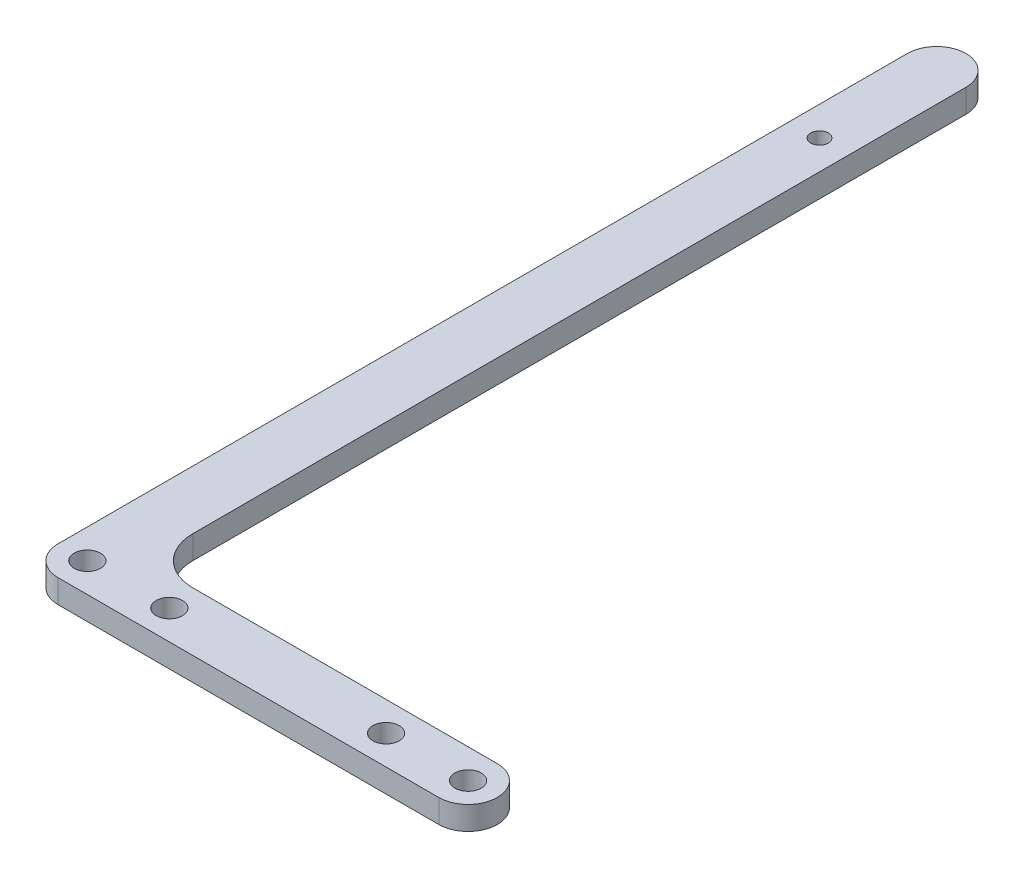
ISO-10303-21;
HEADER;
FILE_DESCRIPTION(('STEP AP214'),'2;1');
FILE_NAME('part.step','',(''),(''),'','','');
FILE_SCHEMA(('AUTOMOTIVE_DESIGN { 1 0 10303 214 1 1 1 1 }'));
ENDSEC;
DATA;
#1=APPLICATION_CONTEXT('core data for automotive mechanical design processes');
#2=APPLICATION_PROTOCOL_DEFINITION('international standard','automotive_design',2000,#1);
#3=PRODUCT_CONTEXT('',#1,'mechanical');
#4=PRODUCT('Part','Part','',(#3));
#5=PRODUCT_RELATED_PRODUCT_CATEGORY('part','',(#4));
#6=PRODUCT_DEFINITION_FORMATION('','',#4);
#7=PRODUCT_DEFINITION_CONTEXT('part definition',#1,'design');
#8=PRODUCT_DEFINITION('design','',#6,#7);
#9=PRODUCT_DEFINITION_SHAPE('','',#8);
#10=(LENGTH_UNIT() NAMED_UNIT(*) SI_UNIT(.MILLI.,.METRE.));
#11=(NAMED_UNIT(*) PLANE_ANGLE_UNIT() SI_UNIT($,.RADIAN.));
#12=(NAMED_UNIT(*) SI_UNIT($,.STERADIAN.) SOLID_ANGLE_UNIT());
#13=UNCERTAINTY_MEASURE_WITH_UNIT(LENGTH_MEASURE(1.E-05),#10,'distance_accuracy_value','');
#14=(GEOMETRIC_REPRESENTATION_CONTEXT(3) GLOBAL_UNCERTAINTY_ASSIGNED_CONTEXT((#13)) GLOBAL_UNIT_ASSIGNED_CONTEXT((#10,
#11,#12)) REPRESENTATION_CONTEXT('',''));
#15=CARTESIAN_POINT('',(0.,0.,0.));
#16=DIRECTION('',(0.,0.,1.));
#17=DIRECTION('',(1.,0.,0.));
#18=AXIS2_PLACEMENT_3D('',#15,#16,#17);
#19=CARTESIAN_POINT('',(5.,4.,-140.));
#20=DIRECTION('',(0.,-1.,0.));
#21=DIRECTION('',(0.,0.,-1.));
#22=AXIS2_PLACEMENT_3D('',#19,#20,#21);
#23=PLANE('',#22);
#24=DIRECTION('',(0.,0.,1.));
#25=VECTOR('',#24,1.);
#26=CARTESIAN_POINT('',(0.,4.,0.));
#27=LINE('',#26,#25);
#28=CARTESIAN_POINT('',(0.,4.,-140.));
#29=VERTEX_POINT('',#28);
#30=CARTESIAN_POINT('',(0.,4.,4.99999999999999));
#31=VERTEX_POINT('',#30);
#32=EDGE_CURVE('E157',#29,#31,#27,.T.);
#33=ORIENTED_EDGE('',*,*,#32,.T.);
#34=CARTESIAN_POINT('',(5.,4.,4.99999999999999));
#35=DIRECTION('',(0.,-1.,0.));
#36=DIRECTION('',(0.,0.,-1.));
#37=AXIS2_PLACEMENT_3D('',#34,#35,#36);
#38=CIRCLE('',#37,5.);
#39=CARTESIAN_POINT('',(5.,4.,9.99999999999999));
#40=VERTEX_POINT('',#39);
#41=EDGE_CURVE('E58',#31,#40,#38,.F.);
#42=ORIENTED_EDGE('',*,*,#41,.T.);
#43=DIRECTION('',(-1.,0.,0.));
#44=VECTOR('',#43,1.);
#45=CARTESIAN_POINT('',(0.,4.,9.99999999999999));
#46=LINE('',#45,#44);
#47=CARTESIAN_POINT('',(70.,4.,9.99999999999997));
#48=VERTEX_POINT('',#47);
#49=EDGE_CURVE('E139',#48,#40,#46,.T.);
#50=ORIENTED_EDGE('',*,*,#49,.F.);
#51=CARTESIAN_POINT('',(70.,4.,5.));
#52=DIRECTION('',(0.,1.,0.));
#53=DIRECTION('',(0.,0.,1.));
#54=AXIS2_PLACEMENT_3D('',#51,#52,#53);
#55=CIRCLE('',#54,4.99999999999998);
#56=CARTESIAN_POINT('',(70.,4.,0.));
#57=VERTEX_POINT('',#56);
#58=EDGE_CURVE('E117',#57,#48,#55,.F.);
#59=ORIENTED_EDGE('',*,*,#58,.F.);
#60=DIRECTION('',(1.,0.,0.));
#61=VECTOR('',#60,1.);
#62=CARTESIAN_POINT('',(0.,4.,0.));
#63=LINE('',#62,#61);
#64=CARTESIAN_POINT('',(18.,4.,0.));
#65=VERTEX_POINT('',#64);
#66=EDGE_CURVE('E137',#65,#57,#63,.T.);
#67=ORIENTED_EDGE('',*,*,#66,.F.);
#68=CARTESIAN_POINT('',(18.,4.,-8.00000000000001));
#69=DIRECTION('',(0.,-1.,0.));
#70=DIRECTION('',(0.,0.,-1.));
#71=AXIS2_PLACEMENT_3D('',#68,#69,#70);
#72=CIRCLE('',#71,8.);
#73=CARTESIAN_POINT('',(10.,4.,-8.00000000000001));
#74=VERTEX_POINT('',#73);
#75=EDGE_CURVE('E181',#65,#74,#72,.T.);
#76=ORIENTED_EDGE('',*,*,#75,.T.);
#77=DIRECTION('',(0.,0.,-1.));
#78=VECTOR('',#77,1.);
#79=CARTESIAN_POINT('',(9.99999999999999,4.,-140.));
#80=LINE('',#79,#78);
#81=CARTESIAN_POINT('',(9.99999999999999,4.,-140.));
#82=VERTEX_POINT('',#81);
#83=EDGE_CURVE('E160',#74,#82,#80,.T.);
#84=ORIENTED_EDGE('',*,*,#83,.T.);
#85=CARTESIAN_POINT('',(5.,4.,-140.));
#86=DIRECTION('',(0.,1.,0.));
#87=DIRECTION('',(0.,0.,-1.));
#88=AXIS2_PLACEMENT_3D('',#85,#86,#87);
#89=CIRCLE('',#88,5.);
#90=EDGE_CURVE('E154',#82,#29,#89,.T.);
#91=ORIENTED_EDGE('',*,*,#90,.T.);
#92=EDGE_LOOP('',(#33,#42,#50,#59,#67,#76,#84,#91));
#93=FACE_BOUND('',#92,.T.);
#94=CARTESIAN_POINT('',(4.99999999999999,4.,-120.));
#95=DIRECTION('',(0.,1.,0.));
#96=DIRECTION('',(0.,0.,1.));
#97=AXIS2_PLACEMENT_3D('',#94,#95,#96);
#98=CIRCLE('',#97,1.5);
#99=CARTESIAN_POINT('',(4.99999999999999,4.,-118.5));
#100=VERTEX_POINT('',#99);
#101=EDGE_CURVE('E148',#100,#100,#98,.T.);
#102=ORIENTED_EDGE('',*,*,#101,.F.);
#103=EDGE_LOOP('',(#102));
#104=FACE_BOUND('',#103,.T.);
#105=CARTESIAN_POINT('',(56.,4.,4.99999999999998));
#106=DIRECTION('',(0.,1.,0.));
#107=DIRECTION('',(0.,0.,1.));
#108=AXIS2_PLACEMENT_3D('',#105,#106,#107);
#109=CIRCLE('',#108,2.25);
#110=CARTESIAN_POINT('',(56.,4.,7.24999999999999));
#111=VERTEX_POINT('',#110);
#112=EDGE_CURVE('E128',#111,#111,#109,.T.);
#113=ORIENTED_EDGE('',*,*,#112,.F.);
#114=EDGE_LOOP('',(#113));
#115=FACE_BOUND('',#114,.T.);
#116=CARTESIAN_POINT('',(19.,4.,4.99999999999999));
#117=DIRECTION('',(0.,1.,0.));
#118=DIRECTION('',(0.,0.,1.));
#119=AXIS2_PLACEMENT_3D('',#116,#117,#118);
#120=CIRCLE('',#119,2.25);
#121=CARTESIAN_POINT('',(19.,4.,7.24999999999999));
#122=VERTEX_POINT('',#121);
#123=EDGE_CURVE('E131',#122,#122,#120,.T.);
#124=ORIENTED_EDGE('',*,*,#123,.F.);
#125=EDGE_LOOP('',(#124));
#126=FACE_BOUND('',#125,.T.);
#127=CARTESIAN_POINT('',(5.,4.,5.));
#128=DIRECTION('',(0.,1.,0.));
#129=DIRECTION('',(0.,0.,1.));
#130=AXIS2_PLACEMENT_3D('',#127,#128,#129);
#131=CIRCLE('',#130,2.25);
#132=CARTESIAN_POINT('',(5.,4.,7.24999999999999));
#133=VERTEX_POINT('',#132);
#134=EDGE_CURVE('E134',#133,#133,#131,.T.);
#135=ORIENTED_EDGE('',*,*,#134,.F.);
#136=EDGE_LOOP('',(#135));
#137=FACE_BOUND('',#136,.T.);
#138=CARTESIAN_POINT('',(70.,4.,5.));
#139=DIRECTION('',(0.,1.,0.));
#140=DIRECTION('',(0.,0.,1.));
#141=AXIS2_PLACEMENT_3D('',#138,#139,#140);
#142=CIRCLE('',#141,2.25);
#143=CARTESIAN_POINT('',(70.,4.,7.24999999999999));
#144=VERTEX_POINT('',#143);
#145=EDGE_CURVE('E142',#144,#144,#142,.T.);
#146=ORIENTED_EDGE('',*,*,#145,.F.);
#147=EDGE_LOOP('',(#146));
#148=FACE_BOUND('',#147,.T.);
#149=ADVANCED_FACE('F36',(#93,#104,#115,#126,#137,#148),#23,.F.);
#150=CARTESIAN_POINT('',(5.,0.,-140.));
#151=DIRECTION('',(0.,-1.,0.));
#152=DIRECTION('',(0.,0.,-1.));
#153=AXIS2_PLACEMENT_3D('',#150,#151,#152);
#154=PLANE('',#153);
#155=DIRECTION('',(-1.,0.,0.));
#156=VECTOR('',#155,1.);
#157=CARTESIAN_POINT('',(0.,0.,9.99999999999999));
#158=LINE('',#157,#156);
#159=CARTESIAN_POINT('',(70.,0.,9.99999999999997));
#160=VERTEX_POINT('',#159);
#161=CARTESIAN_POINT('',(5.,0.,9.99999999999999));
#162=VERTEX_POINT('',#161);
#163=EDGE_CURVE('E104',#160,#162,#158,.T.);
#164=ORIENTED_EDGE('',*,*,#163,.T.);
#165=CARTESIAN_POINT('',(5.,0.,4.99999999999999));
#166=DIRECTION('',(0.,-1.,0.));
#167=DIRECTION('',(0.,0.,-1.));
#168=AXIS2_PLACEMENT_3D('',#165,#166,#167);
#169=CIRCLE('',#168,5.);
#170=CARTESIAN_POINT('',(0.,0.,4.99999999999999));
#171=VERTEX_POINT('',#170);
#172=EDGE_CURVE('E11',#162,#171,#169,.T.);
#173=ORIENTED_EDGE('',*,*,#172,.T.);
#174=DIRECTION('',(0.,0.,1.));
#175=VECTOR('',#174,1.);
#176=CARTESIAN_POINT('',(0.,0.,0.));
#177=LINE('',#176,#175);
#178=CARTESIAN_POINT('',(0.,0.,-140.));
#179=VERTEX_POINT('',#178);
#180=EDGE_CURVE('E165',#179,#171,#177,.T.);
#181=ORIENTED_EDGE('',*,*,#180,.F.);
#182=CARTESIAN_POINT('',(5.,0.,-140.));
#183=DIRECTION('',(0.,1.,0.));
#184=DIRECTION('',(0.,0.,-1.));
#185=AXIS2_PLACEMENT_3D('',#182,#183,#184);
#186=CIRCLE('',#185,5.);
#187=CARTESIAN_POINT('',(9.99999999999999,0.,-140.));
#188=VERTEX_POINT('',#187);
#189=EDGE_CURVE('E151',#188,#179,#186,.T.);
#190=ORIENTED_EDGE('',*,*,#189,.F.);
#191=DIRECTION('',(0.,0.,-1.));
#192=VECTOR('',#191,1.);
#193=CARTESIAN_POINT('',(9.99999999999999,0.,-140.));
#194=LINE('',#193,#192);
#195=CARTESIAN_POINT('',(10.,0.,-8.00000000000001));
#196=VERTEX_POINT('',#195);
#197=EDGE_CURVE('E158',#196,#188,#194,.T.);
#198=ORIENTED_EDGE('',*,*,#197,.F.);
#199=CARTESIAN_POINT('',(18.,0.,-8.00000000000001));
#200=DIRECTION('',(0.,-1.,0.));
#201=DIRECTION('',(0.,0.,-1.));
#202=AXIS2_PLACEMENT_3D('',#199,#200,#201);
#203=CIRCLE('',#202,8.);
#204=CARTESIAN_POINT('',(18.,0.,0.));
#205=VERTEX_POINT('',#204);
#206=EDGE_CURVE('E179',#196,#205,#203,.F.);
#207=ORIENTED_EDGE('',*,*,#206,.T.);
#208=DIRECTION('',(1.,0.,0.));
#209=VECTOR('',#208,1.);
#210=CARTESIAN_POINT('',(0.,0.,0.));
#211=LINE('',#210,#209);
#212=CARTESIAN_POINT('',(70.,0.,0.));
#213=VERTEX_POINT('',#212);
#214=EDGE_CURVE('E107',#205,#213,#211,.T.);
#215=ORIENTED_EDGE('',*,*,#214,.T.);
#216=CARTESIAN_POINT('',(70.,0.,5.));
#217=DIRECTION('',(0.,1.,0.));
#218=DIRECTION('',(0.,0.,1.));
#219=AXIS2_PLACEMENT_3D('',#216,#217,#218);
#220=CIRCLE('',#219,4.99999999999998);
#221=EDGE_CURVE('E100',#213,#160,#220,.F.);
#222=ORIENTED_EDGE('',*,*,#221,.T.);
#223=EDGE_LOOP('',(#164,#173,#181,#190,#198,#207,#215,#222));
#224=FACE_BOUND('',#223,.T.);
#225=CARTESIAN_POINT('',(4.99999999999999,0.,-120.));
#226=DIRECTION('',(0.,1.,0.));
#227=DIRECTION('',(0.,0.,1.));
#228=AXIS2_PLACEMENT_3D('',#225,#226,#227);
#229=CIRCLE('',#228,1.5);
#230=CARTESIAN_POINT('',(4.99999999999999,0.,-118.5));
#231=VERTEX_POINT('',#230);
#232=EDGE_CURVE('E146',#231,#231,#229,.T.);
#233=ORIENTED_EDGE('',*,*,#232,.T.);
#234=EDGE_LOOP('',(#233));
#235=FACE_BOUND('',#234,.T.);
#236=CARTESIAN_POINT('',(56.,0.,4.99999999999998));
#237=DIRECTION('',(0.,1.,0.));
#238=DIRECTION('',(0.,0.,1.));
#239=AXIS2_PLACEMENT_3D('',#236,#237,#238);
#240=CIRCLE('',#239,2.25);
#241=CARTESIAN_POINT('',(56.,0.,7.24999999999999));
#242=VERTEX_POINT('',#241);
#243=EDGE_CURVE('E145',#242,#242,#240,.T.);
#244=ORIENTED_EDGE('',*,*,#243,.T.);
#245=EDGE_LOOP('',(#244));
#246=FACE_BOUND('',#245,.T.);
#247=CARTESIAN_POINT('',(19.,0.,4.99999999999999));
#248=DIRECTION('',(0.,1.,0.));
#249=DIRECTION('',(0.,0.,1.));
#250=AXIS2_PLACEMENT_3D('',#247,#248,#249);
#251=CIRCLE('',#250,2.25);
#252=CARTESIAN_POINT('',(19.,0.,7.24999999999999));
#253=VERTEX_POINT('',#252);
#254=EDGE_CURVE('E362',#253,#253,#251,.T.);
#255=ORIENTED_EDGE('',*,*,#254,.T.);
#256=EDGE_LOOP('',(#255));
#257=FACE_BOUND('',#256,.T.);
#258=CARTESIAN_POINT('',(5.,0.,5.));
#259=DIRECTION('',(0.,1.,0.));
#260=DIRECTION('',(0.,0.,1.));
#261=AXIS2_PLACEMENT_3D('',#258,#259,#260);
#262=CIRCLE('',#261,2.25);
#263=CARTESIAN_POINT('',(5.,0.,7.24999999999999));
#264=VERTEX_POINT('',#263);
#265=EDGE_CURVE('E122',#264,#264,#262,.T.);
#266=ORIENTED_EDGE('',*,*,#265,.T.);
#267=EDGE_LOOP('',(#266));
#268=FACE_BOUND('',#267,.T.);
#269=CARTESIAN_POINT('',(70.,0.,5.));
#270=DIRECTION('',(0.,1.,0.));
#271=DIRECTION('',(0.,0.,1.));
#272=AXIS2_PLACEMENT_3D('',#269,#270,#271);
#273=CIRCLE('',#272,2.25);
#274=CARTESIAN_POINT('',(70.,0.,7.24999999999999));
#275=VERTEX_POINT('',#274);
#276=EDGE_CURVE('E111',#275,#275,#273,.T.);
#277=ORIENTED_EDGE('',*,*,#276,.T.);
#278=EDGE_LOOP('',(#277));
#279=FACE_BOUND('',#278,.T.);
#280=ADVANCED_FACE('F102',(#224,#235,#246,#257,#268,#279),#154,.T.);
#281=CARTESIAN_POINT('',(5.,4.,-140.));
#282=DIRECTION('',(0.,-1.,0.));
#283=DIRECTION('',(0.,0.,-1.));
#284=AXIS2_PLACEMENT_3D('',#281,#282,#283);
#285=CYLINDRICAL_SURFACE('',#284,5.);
#286=ORIENTED_EDGE('',*,*,#189,.T.);
#287=DIRECTION('',(0.,-1.,0.));
#288=VECTOR('',#287,1.);
#289=CARTESIAN_POINT('',(0.,4.,-140.));
#290=LINE('',#289,#288);
#291=EDGE_CURVE('E171',#29,#179,#290,.T.);
#292=ORIENTED_EDGE('',*,*,#291,.F.);
#293=ORIENTED_EDGE('',*,*,#90,.F.);
#294=DIRECTION('',(0.,-1.,0.));
#295=VECTOR('',#294,1.);
#296=CARTESIAN_POINT('',(9.99999999999999,4.,-140.));
#297=LINE('',#296,#295);
#298=EDGE_CURVE('E162',#82,#188,#297,.T.);
#299=ORIENTED_EDGE('',*,*,#298,.T.);
#300=EDGE_LOOP('',(#286,#292,#293,#299));
#301=FACE_BOUND('',#300,.T.);
#302=ADVANCED_FACE('F196',(#301),#285,.T.);
#303=CARTESIAN_POINT('',(0.,4.,0.));
#304=DIRECTION('',(1.,0.,0.));
#305=DIRECTION('',(0.,0.,-1.));
#306=AXIS2_PLACEMENT_3D('',#303,#304,#305);
#307=PLANE('',#306);
#308=ORIENTED_EDGE('',*,*,#180,.T.);
#309=DIRECTION('',(0.,1.,0.));
#310=VECTOR('',#309,1.);
#311=CARTESIAN_POINT('',(0.,4.,4.99999999999999));
#312=LINE('',#311,#310);
#313=EDGE_CURVE('E183',#171,#31,#312,.T.);
#314=ORIENTED_EDGE('',*,*,#313,.T.);
#315=ORIENTED_EDGE('',*,*,#32,.F.);
#316=ORIENTED_EDGE('',*,*,#291,.T.);
#317=EDGE_LOOP('',(#308,#314,#315,#316));
#318=FACE_BOUND('',#317,.T.);
#319=ADVANCED_FACE('F188',(#318),#307,.F.);
#320=CARTESIAN_POINT('',(9.99999999999999,4.,-140.));
#321=DIRECTION('',(-1.,0.,0.));
#322=DIRECTION('',(0.,0.,1.));
#323=AXIS2_PLACEMENT_3D('',#320,#321,#322);
#324=PLANE('',#323);
#325=ORIENTED_EDGE('',*,*,#83,.F.);
#326=DIRECTION('',(0.,-1.,0.));
#327=VECTOR('',#326,1.);
#328=CARTESIAN_POINT('',(10.,0.,-8.00000000000001));
#329=LINE('',#328,#327);
#330=EDGE_CURVE('E174',#74,#196,#329,.T.);
#331=ORIENTED_EDGE('',*,*,#330,.T.);
#332=ORIENTED_EDGE('',*,*,#197,.T.);
#333=ORIENTED_EDGE('',*,*,#298,.F.);
#334=EDGE_LOOP('',(#325,#331,#332,#333));
#335=FACE_BOUND('',#334,.T.);
#336=ADVANCED_FACE('F216',(#335),#324,.F.);
#337=CARTESIAN_POINT('',(4.99999999999999,4.,-120.));
#338=DIRECTION('',(0.,-1.,0.));
#339=DIRECTION('',(0.,0.,-1.));
#340=AXIS2_PLACEMENT_3D('',#337,#338,#339);
#341=CYLINDRICAL_SURFACE('',#340,1.5);
#342=ORIENTED_EDGE('',*,*,#101,.T.);
#343=EDGE_LOOP('',(#342));
#344=FACE_BOUND('',#343,.T.);
#345=ORIENTED_EDGE('',*,*,#232,.F.);
#346=EDGE_LOOP('',(#345));
#347=FACE_BOUND('',#346,.T.);
#348=ADVANCED_FACE('F213',(#344,#347),#341,.F.);
#349=CARTESIAN_POINT('',(0.,0.,0.));
#350=DIRECTION('',(0.,0.,1.));
#351=DIRECTION('',(1.,0.,0.));
#352=AXIS2_PLACEMENT_3D('',#349,#350,#351);
#353=PLANE('',#352);
#354=ORIENTED_EDGE('',*,*,#214,.F.);
#355=DIRECTION('',(0.,-1.,0.));
#356=VECTOR('',#355,1.);
#357=CARTESIAN_POINT('',(18.,4.,0.));
#358=LINE('',#357,#356);
#359=EDGE_CURVE('E177',#205,#65,#358,.F.);
#360=ORIENTED_EDGE('',*,*,#359,.T.);
#361=ORIENTED_EDGE('',*,*,#66,.T.);
#362=DIRECTION('',(0.,1.,0.));
#363=VECTOR('',#362,1.);
#364=CARTESIAN_POINT('',(70.,0.,0.));
#365=LINE('',#364,#363);
#366=EDGE_CURVE('E118',#213,#57,#365,.T.);
#367=ORIENTED_EDGE('',*,*,#366,.F.);
#368=EDGE_LOOP('',(#354,#360,#361,#367));
#369=FACE_BOUND('',#368,.T.);
#370=ADVANCED_FACE('F244',(#369),#353,.F.);
#371=CARTESIAN_POINT('',(70.,0.,5.));
#372=DIRECTION('',(0.,1.,0.));
#373=DIRECTION('',(0.,0.,1.));
#374=AXIS2_PLACEMENT_3D('',#371,#372,#373);
#375=CYLINDRICAL_SURFACE('',#374,4.99999999999998);
#376=ORIENTED_EDGE('',*,*,#58,.T.);
#377=DIRECTION('',(0.,1.,0.));
#378=VECTOR('',#377,1.);
#379=CARTESIAN_POINT('',(70.,0.,9.99999999999997));
#380=LINE('',#379,#378);
#381=EDGE_CURVE('E114',#160,#48,#380,.T.);
#382=ORIENTED_EDGE('',*,*,#381,.F.);
#383=ORIENTED_EDGE('',*,*,#221,.F.);
#384=ORIENTED_EDGE('',*,*,#366,.T.);
#385=EDGE_LOOP('',(#376,#382,#383,#384));
#386=FACE_BOUND('',#385,.T.);
#387=ADVANCED_FACE('F115',(#386),#375,.T.);
#388=CARTESIAN_POINT('',(0.,0.,9.99999999999999));
#389=DIRECTION('',(0.,0.,-1.));
#390=DIRECTION('',(-1.,0.,0.));
#391=AXIS2_PLACEMENT_3D('',#388,#389,#390);
#392=PLANE('',#391);
#393=ORIENTED_EDGE('',*,*,#49,.T.);
#394=DIRECTION('',(0.,1.,0.));
#395=VECTOR('',#394,1.);
#396=CARTESIAN_POINT('',(5.,0.,9.99999999999999));
#397=LINE('',#396,#395);
#398=EDGE_CURVE('E44',#40,#162,#397,.F.);
#399=ORIENTED_EDGE('',*,*,#398,.T.);
#400=ORIENTED_EDGE('',*,*,#163,.F.);
#401=ORIENTED_EDGE('',*,*,#381,.T.);
#402=EDGE_LOOP('',(#393,#399,#400,#401));
#403=FACE_BOUND('',#402,.T.);
#404=ADVANCED_FACE('F120',(#403),#392,.F.);
#405=CARTESIAN_POINT('',(5.,0.,5.));
#406=DIRECTION('',(0.,1.,0.));
#407=DIRECTION('',(0.,0.,1.));
#408=AXIS2_PLACEMENT_3D('',#405,#406,#407);
#409=CYLINDRICAL_SURFACE('',#408,2.25);
#410=ORIENTED_EDGE('',*,*,#265,.F.);
#411=EDGE_LOOP('',(#410));
#412=FACE_BOUND('',#411,.T.);
#413=ORIENTED_EDGE('',*,*,#134,.T.);
#414=EDGE_LOOP('',(#413));
#415=FACE_BOUND('',#414,.T.);
#416=ADVANCED_FACE('F264',(#412,#415),#409,.F.);
#417=CARTESIAN_POINT('',(19.,0.,4.99999999999999));
#418=DIRECTION('',(0.,1.,0.));
#419=DIRECTION('',(0.,0.,1.));
#420=AXIS2_PLACEMENT_3D('',#417,#418,#419);
#421=CYLINDRICAL_SURFACE('',#420,2.25);
#422=ORIENTED_EDGE('',*,*,#254,.F.);
#423=EDGE_LOOP('',(#422));
#424=FACE_BOUND('',#423,.T.);
#425=ORIENTED_EDGE('',*,*,#123,.T.);
#426=EDGE_LOOP('',(#425));
#427=FACE_BOUND('',#426,.T.);
#428=ADVANCED_FACE('F270',(#424,#427),#421,.F.);
#429=CARTESIAN_POINT('',(56.,0.,4.99999999999998));
#430=DIRECTION('',(0.,1.,0.));
#431=DIRECTION('',(0.,0.,1.));
#432=AXIS2_PLACEMENT_3D('',#429,#430,#431);
#433=CYLINDRICAL_SURFACE('',#432,2.25);
#434=ORIENTED_EDGE('',*,*,#243,.F.);
#435=EDGE_LOOP('',(#434));
#436=FACE_BOUND('',#435,.T.);
#437=ORIENTED_EDGE('',*,*,#112,.T.);
#438=EDGE_LOOP('',(#437));
#439=FACE_BOUND('',#438,.T.);
#440=ADVANCED_FACE('F278',(#436,#439),#433,.F.);
#441=CARTESIAN_POINT('',(70.,0.,5.));
#442=DIRECTION('',(0.,1.,0.));
#443=DIRECTION('',(0.,0.,1.));
#444=AXIS2_PLACEMENT_3D('',#441,#442,#443);
#445=CYLINDRICAL_SURFACE('',#444,2.25);
#446=ORIENTED_EDGE('',*,*,#276,.F.);
#447=EDGE_LOOP('',(#446));
#448=FACE_BOUND('',#447,.T.);
#449=ORIENTED_EDGE('',*,*,#145,.T.);
#450=EDGE_LOOP('',(#449));
#451=FACE_BOUND('',#450,.T.);
#452=ADVANCED_FACE('F204',(#448,#451),#445,.F.);
#453=CARTESIAN_POINT('',(18.,4.,-8.00000000000001));
#454=DIRECTION('',(0.,1.,0.));
#455=DIRECTION('',(0.,0.,1.));
#456=AXIS2_PLACEMENT_3D('',#453,#454,#455);
#457=CYLINDRICAL_SURFACE('',#456,8.);
#458=ORIENTED_EDGE('',*,*,#75,.F.);
#459=ORIENTED_EDGE('',*,*,#359,.F.);
#460=ORIENTED_EDGE('',*,*,#206,.F.);
#461=ORIENTED_EDGE('',*,*,#330,.F.);
#462=EDGE_LOOP('',(#458,#459,#460,#461));
#463=FACE_BOUND('',#462,.T.);
#464=ADVANCED_FACE('F200',(#463),#457,.F.);
#465=CARTESIAN_POINT('',(5.,4.,4.99999999999999));
#466=DIRECTION('',(0.,1.,0.));
#467=DIRECTION('',(0.,0.,1.));
#468=AXIS2_PLACEMENT_3D('',#465,#466,#467);
#469=CYLINDRICAL_SURFACE('',#468,5.);
#470=ORIENTED_EDGE('',*,*,#172,.F.);
#471=ORIENTED_EDGE('',*,*,#398,.F.);
#472=ORIENTED_EDGE('',*,*,#41,.F.);
#473=ORIENTED_EDGE('',*,*,#313,.F.);
#474=EDGE_LOOP('',(#470,#471,#472,#473));
#475=FACE_BOUND('',#474,.T.);
#476=ADVANCED_FACE('F38',(#475),#469,.T.);
#477=CLOSED_SHELL('',(#149,#280,#302,#319,#336,#348,#370,#387,#404,#416,#428,#440,#452,#464,#476));
#478=MANIFOLD_SOLID_BREP('B2',#477);
#479=ADVANCED_BREP_SHAPE_REPRESENTATION('',(#18,#478),#14);
#480=SHAPE_DEFINITION_REPRESENTATION(#9,#479);
ENDSEC;
END-ISO-10303-21;
